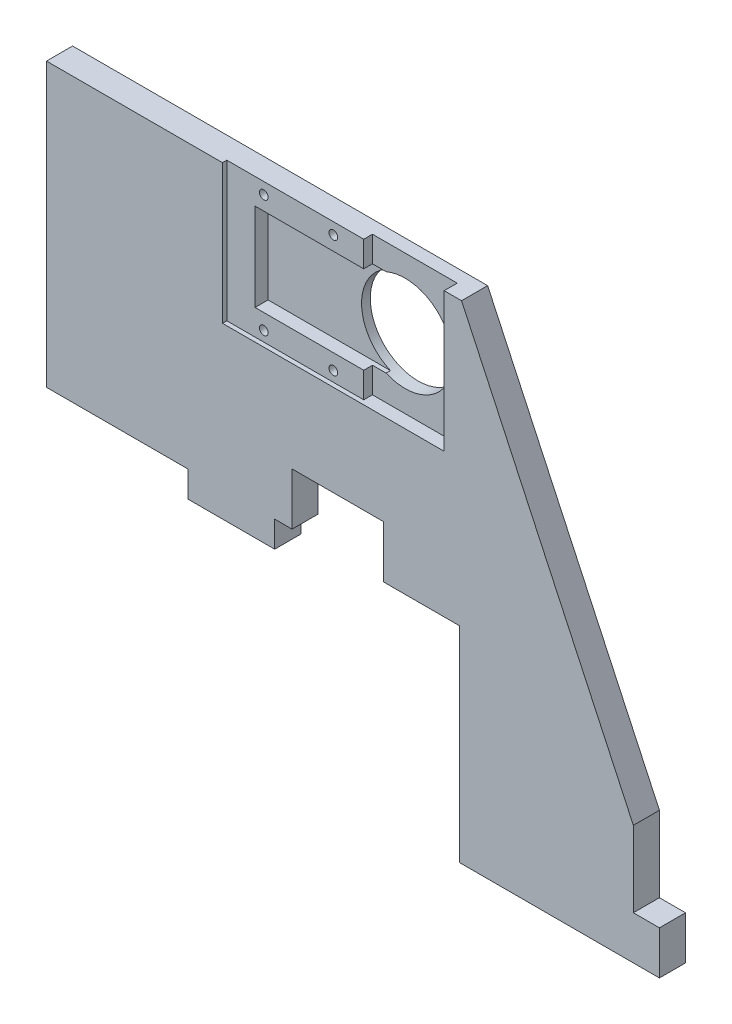
ISO-10303-21;
HEADER;
FILE_DESCRIPTION(('STEP AP214'),'2;1');
FILE_NAME('part.step','',(''),(''),'','','');
FILE_SCHEMA(('AUTOMOTIVE_DESIGN { 1 0 10303 214 1 1 1 1 }'));
ENDSEC;
DATA;
#1=APPLICATION_CONTEXT('core data for automotive mechanical design processes');
#2=APPLICATION_PROTOCOL_DEFINITION('international standard','automotive_design',2000,#1);
#3=PRODUCT_CONTEXT('',#1,'mechanical');
#4=PRODUCT('Part','Part','',(#3));
#5=PRODUCT_RELATED_PRODUCT_CATEGORY('part','',(#4));
#6=PRODUCT_DEFINITION_FORMATION('','',#4);
#7=PRODUCT_DEFINITION_CONTEXT('part definition',#1,'design');
#8=PRODUCT_DEFINITION('design','',#6,#7);
#9=PRODUCT_DEFINITION_SHAPE('','',#8);
#10=(LENGTH_UNIT() NAMED_UNIT(*) SI_UNIT(.MILLI.,.METRE.));
#11=(NAMED_UNIT(*) PLANE_ANGLE_UNIT() SI_UNIT($,.RADIAN.));
#12=(NAMED_UNIT(*) SI_UNIT($,.STERADIAN.) SOLID_ANGLE_UNIT());
#13=UNCERTAINTY_MEASURE_WITH_UNIT(LENGTH_MEASURE(1.E-05),#10,'distance_accuracy_value','');
#14=(GEOMETRIC_REPRESENTATION_CONTEXT(3) GLOBAL_UNCERTAINTY_ASSIGNED_CONTEXT((#13)) GLOBAL_UNIT_ASSIGNED_CONTEXT((#10,
#11,#12)) REPRESENTATION_CONTEXT('',''));
#15=CARTESIAN_POINT('',(0.,0.,0.));
#16=DIRECTION('',(0.,0.,1.));
#17=DIRECTION('',(1.,0.,0.));
#18=AXIS2_PLACEMENT_3D('',#15,#16,#17);
#19=CARTESIAN_POINT('',(-38.5,-8.91500000000001,0.));
#20=DIRECTION('',(0.,1.,0.));
#21=DIRECTION('',(0.,0.,1.));
#22=AXIS2_PLACEMENT_3D('',#19,#20,#21);
#23=PLANE('',#22);
#24=DIRECTION('',(-1.,0.,0.));
#25=VECTOR('',#24,1.);
#26=CARTESIAN_POINT('',(-38.5,-8.91500000000001,0.));
#27=LINE('',#26,#25);
#28=CARTESIAN_POINT('',(-11.,-8.915,0.));
#29=VERTEX_POINT('',#28);
#30=CARTESIAN_POINT('',(-15.,-8.91500000000001,0.));
#31=VERTEX_POINT('',#30);
#32=EDGE_CURVE('E241',#29,#31,#27,.T.);
#33=ORIENTED_EDGE('',*,*,#32,.F.);
#34=DIRECTION('',(0.,0.,1.));
#35=VECTOR('',#34,1.);
#36=CARTESIAN_POINT('',(-11.,-8.915,0.));
#37=LINE('',#36,#35);
#38=CARTESIAN_POINT('',(-11.,-8.915,6.));
#39=VERTEX_POINT('',#38);
#40=EDGE_CURVE('E225',#29,#39,#37,.T.);
#41=ORIENTED_EDGE('',*,*,#40,.T.);
#42=DIRECTION('',(-1.,0.,0.));
#43=VECTOR('',#42,1.);
#44=CARTESIAN_POINT('',(-38.5,-8.91500000000001,6.));
#45=LINE('',#44,#43);
#46=CARTESIAN_POINT('',(-15.,-8.91500000000001,6.));
#47=VERTEX_POINT('',#46);
#48=EDGE_CURVE('E266',#39,#47,#45,.T.);
#49=ORIENTED_EDGE('',*,*,#48,.T.);
#50=DIRECTION('',(0.,0.,1.));
#51=VECTOR('',#50,1.);
#52=CARTESIAN_POINT('',(-15.,-8.915,0.));
#53=LINE('',#52,#51);
#54=EDGE_CURVE('E247',#31,#47,#53,.T.);
#55=ORIENTED_EDGE('',*,*,#54,.F.);
#56=EDGE_LOOP('',(#33,#41,#49,#55));
#57=FACE_BOUND('',#56,.T.);
#58=ADVANCED_FACE('F33',(#57),#23,.F.);
#59=CARTESIAN_POINT('',(0.,0.,3.));
#60=DIRECTION('',(0.,0.,1.));
#61=DIRECTION('',(1.,0.,0.));
#62=AXIS2_PLACEMENT_3D('',#59,#60,#61);
#63=PLANE('',#62);
#64=DIRECTION('',(1.,0.,0.));
#65=VECTOR('',#64,1.);
#66=CARTESIAN_POINT('',(-20.5195740286363,29.985,3.));
#67=LINE('',#66,#65);
#68=CARTESIAN_POINT('',(4.4804259713637,29.985,3.));
#69=VERTEX_POINT('',#68);
#70=CARTESIAN_POINT('',(7.62267425746352,29.985,3.));
#71=VERTEX_POINT('',#70);
#72=EDGE_CURVE('E515',#69,#71,#67,.T.);
#73=ORIENTED_EDGE('',*,*,#72,.F.);
#74=DIRECTION('',(0.,1.,0.));
#75=VECTOR('',#74,1.);
#76=CARTESIAN_POINT('',(4.4804259713637,29.985,3.));
#77=LINE('',#76,#75);
#78=CARTESIAN_POINT('',(4.48042597136369,24.085,3.));
#79=VERTEX_POINT('',#78);
#80=EDGE_CURVE('E489',#79,#69,#77,.T.);
#81=ORIENTED_EDGE('',*,*,#80,.F.);
#82=DIRECTION('',(1.,0.,0.));
#83=VECTOR('',#82,1.);
#84=CARTESIAN_POINT('',(-27.0195740286363,24.085,3.));
#85=LINE('',#84,#83);
#86=CARTESIAN_POINT('',(23.9804259713637,24.085,3.));
#87=VERTEX_POINT('',#86);
#88=EDGE_CURVE('E537',#79,#87,#85,.T.);
#89=ORIENTED_EDGE('',*,*,#88,.T.);
#90=DIRECTION('',(0.,1.,0.));
#91=VECTOR('',#90,1.);
#92=CARTESIAN_POINT('',(23.9804259713637,56.085,3.));
#93=LINE('',#92,#91);
#94=CARTESIAN_POINT('',(23.9804259713637,56.085,3.));
#95=VERTEX_POINT('',#94);
#96=EDGE_CURVE('E539',#87,#95,#93,.T.);
#97=ORIENTED_EDGE('',*,*,#96,.T.);
#98=DIRECTION('',(-1.,0.,0.));
#99=VECTOR('',#98,1.);
#100=CARTESIAN_POINT('',(-27.0195740286363,56.085,3.));
#101=LINE('',#100,#99);
#102=CARTESIAN_POINT('',(4.4804259713637,56.085,3.));
#103=VERTEX_POINT('',#102);
#104=EDGE_CURVE('E543',#95,#103,#101,.T.);
#105=ORIENTED_EDGE('',*,*,#104,.T.);
#106=DIRECTION('',(0.,1.,0.));
#107=VECTOR('',#106,1.);
#108=CARTESIAN_POINT('',(4.4804259713637,56.085,3.));
#109=LINE('',#108,#107);
#110=CARTESIAN_POINT('',(4.4804259713637,50.185,3.));
#111=VERTEX_POINT('',#110);
#112=EDGE_CURVE('E501',#111,#103,#109,.T.);
#113=ORIENTED_EDGE('',*,*,#112,.F.);
#114=DIRECTION('',(-1.,0.,0.));
#115=VECTOR('',#114,1.);
#116=CARTESIAN_POINT('',(-20.5195740286363,50.185,3.));
#117=LINE('',#116,#115);
#118=CARTESIAN_POINT('',(7.62267425746353,50.185,3.));
#119=VERTEX_POINT('',#118);
#120=EDGE_CURVE('E520',#119,#111,#117,.T.);
#121=ORIENTED_EDGE('',*,*,#120,.F.);
#122=CARTESIAN_POINT('',(11.9804259713637,40.085,3.));
#123=DIRECTION('',(0.,0.,1.));
#124=DIRECTION('',(1.,0.,0.));
#125=AXIS2_PLACEMENT_3D('',#122,#123,#124);
#126=CIRCLE('',#125,11.);
#127=EDGE_CURVE('E530',#71,#119,#126,.T.);
#128=ORIENTED_EDGE('',*,*,#127,.F.);
#129=EDGE_LOOP('',(#73,#81,#89,#97,#105,#113,#121,#128));
#130=FACE_BOUND('',#129,.T.);
#131=ADVANCED_FACE('F419',(#130),#63,.T.);
#132=CARTESIAN_POINT('',(-27.0195740286363,24.085,3.));
#133=DIRECTION('',(0.,-1.,0.));
#134=DIRECTION('',(0.,0.,-1.));
#135=AXIS2_PLACEMENT_3D('',#132,#133,#134);
#136=PLANE('',#135);
#137=DIRECTION('',(1.,0.,0.));
#138=VECTOR('',#137,1.);
#139=CARTESIAN_POINT('',(-20.5195740286363,24.085,5.));
#140=LINE('',#139,#138);
#141=CARTESIAN_POINT('',(-27.0195740286363,24.085,5.));
#142=VERTEX_POINT('',#141);
#143=CARTESIAN_POINT('',(4.48042597136369,24.085,5.));
#144=VERTEX_POINT('',#143);
#145=EDGE_CURVE('E490',#142,#144,#140,.T.);
#146=ORIENTED_EDGE('',*,*,#145,.F.);
#147=DIRECTION('',(0.,0.,1.));
#148=VECTOR('',#147,1.);
#149=CARTESIAN_POINT('',(-27.0195740286363,24.085,3.));
#150=LINE('',#149,#148);
#151=CARTESIAN_POINT('',(-27.0195740286363,24.085,6.));
#152=VERTEX_POINT('',#151);
#153=EDGE_CURVE('E546',#142,#152,#150,.T.);
#154=ORIENTED_EDGE('',*,*,#153,.T.);
#155=DIRECTION('',(1.,0.,0.));
#156=VECTOR('',#155,1.);
#157=CARTESIAN_POINT('',(-27.0195740286363,24.085,6.));
#158=LINE('',#157,#156);
#159=CARTESIAN_POINT('',(23.9804259713637,24.085,6.));
#160=VERTEX_POINT('',#159);
#161=EDGE_CURVE('E548',#152,#160,#158,.T.);
#162=ORIENTED_EDGE('',*,*,#161,.T.);
#163=DIRECTION('',(0.,0.,1.));
#164=VECTOR('',#163,1.);
#165=CARTESIAN_POINT('',(23.9804259713637,24.085,3.));
#166=LINE('',#165,#164);
#167=EDGE_CURVE('E555',#87,#160,#166,.T.);
#168=ORIENTED_EDGE('',*,*,#167,.F.);
#169=ORIENTED_EDGE('',*,*,#88,.F.);
#170=DIRECTION('',(0.,0.,-1.));
#171=VECTOR('',#170,1.);
#172=CARTESIAN_POINT('',(4.48042597136369,24.085,5.));
#173=LINE('',#172,#171);
#174=EDGE_CURVE('E499',#144,#79,#173,.T.);
#175=ORIENTED_EDGE('',*,*,#174,.F.);
#176=EDGE_LOOP('',(#146,#154,#162,#168,#169,#175));
#177=FACE_BOUND('',#176,.T.);
#178=ADVANCED_FACE('F427',(#177),#136,.F.);
#179=CARTESIAN_POINT('',(-35.,-8.91500000000001,0.));
#180=VERTEX_POINT('',#179);
#181=CARTESIAN_POINT('',(-67.5,-8.91500000000001,0.));
#182=VERTEX_POINT('',#181);
#183=EDGE_CURVE('E250',#180,#182,#27,.T.);
#184=ORIENTED_EDGE('',*,*,#183,.F.);
#185=DIRECTION('',(0.,0.,1.));
#186=VECTOR('',#185,1.);
#187=CARTESIAN_POINT('',(-35.,-8.915,0.));
#188=LINE('',#187,#186);
#189=CARTESIAN_POINT('',(-35.,-8.915,6.));
#190=VERTEX_POINT('',#189);
#191=EDGE_CURVE('E353',#180,#190,#188,.T.);
#192=ORIENTED_EDGE('',*,*,#191,.T.);
#193=CARTESIAN_POINT('',(-67.5,-8.91500000000001,6.));
#194=VERTEX_POINT('',#193);
#195=EDGE_CURVE('E261',#190,#194,#45,.T.);
#196=ORIENTED_EDGE('',*,*,#195,.T.);
#197=DIRECTION('',(0.,0.,1.));
#198=VECTOR('',#197,1.);
#199=CARTESIAN_POINT('',(-67.5,-8.91500000000001,0.));
#200=LINE('',#199,#198);
#201=EDGE_CURVE('E270',#182,#194,#200,.T.);
#202=ORIENTED_EDGE('',*,*,#201,.F.);
#203=EDGE_LOOP('',(#184,#192,#196,#202));
#204=FACE_BOUND('',#203,.T.);
#205=ADVANCED_FACE('F350',(#204),#23,.F.);
#206=CARTESIAN_POINT('',(67.5,56.085,6.));
#207=DIRECTION('',(-1.,0.,0.));
#208=DIRECTION('',(0.,0.,1.));
#209=AXIS2_PLACEMENT_3D('',#206,#207,#208);
#210=PLANE('',#209);
#211=DIRECTION('',(0.,0.,1.));
#212=VECTOR('',#211,1.);
#213=CARTESIAN_POINT('',(67.5,-46.085,0.));
#214=LINE('',#213,#212);
#215=CARTESIAN_POINT('',(67.5,-46.085,0.));
#216=VERTEX_POINT('',#215);
#217=CARTESIAN_POINT('',(67.5,-46.085,6.));
#218=VERTEX_POINT('',#217);
#219=EDGE_CURVE('E292',#216,#218,#214,.T.);
#220=ORIENTED_EDGE('',*,*,#219,.F.);
#221=DIRECTION('',(0.,1.,0.));
#222=VECTOR('',#221,1.);
#223=CARTESIAN_POINT('',(67.5,56.085,0.));
#224=LINE('',#223,#222);
#225=CARTESIAN_POINT('',(67.5,-28.6649999999999,0.));
#226=VERTEX_POINT('',#225);
#227=EDGE_CURVE('E289',#216,#226,#224,.T.);
#228=ORIENTED_EDGE('',*,*,#227,.T.);
#229=DIRECTION('',(0.,0.,1.));
#230=VECTOR('',#229,1.);
#231=CARTESIAN_POINT('',(67.5,-28.665,0.));
#232=LINE('',#231,#230);
#233=CARTESIAN_POINT('',(67.5,-28.665,6.));
#234=VERTEX_POINT('',#233);
#235=EDGE_CURVE('E262',#226,#234,#232,.T.);
#236=ORIENTED_EDGE('',*,*,#235,.T.);
#237=DIRECTION('',(0.,1.,0.));
#238=VECTOR('',#237,1.);
#239=CARTESIAN_POINT('',(67.5,56.085,6.));
#240=LINE('',#239,#238);
#241=EDGE_CURVE('E280',#218,#234,#240,.T.);
#242=ORIENTED_EDGE('',*,*,#241,.F.);
#243=EDGE_LOOP('',(#220,#228,#236,#242));
#244=FACE_BOUND('',#243,.T.);
#245=ADVANCED_FACE('F396',(#244),#210,.F.);
#246=CARTESIAN_POINT('',(-67.5,56.085,6.));
#247=DIRECTION('',(1.,0.,0.));
#248=DIRECTION('',(0.,0.,-1.));
#249=AXIS2_PLACEMENT_3D('',#246,#247,#248);
#250=PLANE('',#249);
#251=DIRECTION('',(0.,-1.,0.));
#252=VECTOR('',#251,1.);
#253=CARTESIAN_POINT('',(-67.5,56.085,0.));
#254=LINE('',#253,#252);
#255=CARTESIAN_POINT('',(-67.5,56.085,0.));
#256=VERTEX_POINT('',#255);
#257=EDGE_CURVE('E269',#256,#182,#254,.T.);
#258=ORIENTED_EDGE('',*,*,#257,.T.);
#259=ORIENTED_EDGE('',*,*,#201,.T.);
#260=DIRECTION('',(0.,-1.,0.));
#261=VECTOR('',#260,1.);
#262=CARTESIAN_POINT('',(-67.5,56.085,6.));
#263=LINE('',#262,#261);
#264=CARTESIAN_POINT('',(-67.5,56.085,6.));
#265=VERTEX_POINT('',#264);
#266=EDGE_CURVE('E274',#265,#194,#263,.T.);
#267=ORIENTED_EDGE('',*,*,#266,.F.);
#268=DIRECTION('',(0.,0.,-1.));
#269=VECTOR('',#268,1.);
#270=CARTESIAN_POINT('',(-67.5,56.085,6.));
#271=LINE('',#270,#269);
#272=EDGE_CURVE('E335',#265,#256,#271,.T.);
#273=ORIENTED_EDGE('',*,*,#272,.T.);
#274=EDGE_LOOP('',(#258,#259,#267,#273));
#275=FACE_BOUND('',#274,.T.);
#276=ADVANCED_FACE('F35',(#275),#250,.F.);
#277=CARTESIAN_POINT('',(-67.5,-56.085,6.));
#278=DIRECTION('',(0.,1.,0.));
#279=DIRECTION('',(0.,0.,1.));
#280=AXIS2_PLACEMENT_3D('',#277,#278,#279);
#281=PLANE('',#280);
#282=DIRECTION('',(1.,0.,0.));
#283=VECTOR('',#282,1.);
#284=CARTESIAN_POINT('',(-67.5,-56.085,6.));
#285=LINE('',#284,#283);
#286=CARTESIAN_POINT('',(27.5,-56.085,6.));
#287=VERTEX_POINT('',#286);
#288=CARTESIAN_POINT('',(73.5,-56.085,6.));
#289=VERTEX_POINT('',#288);
#290=EDGE_CURVE('E277',#287,#289,#285,.T.);
#291=ORIENTED_EDGE('',*,*,#290,.F.);
#292=DIRECTION('',(0.,0.,1.));
#293=VECTOR('',#292,1.);
#294=CARTESIAN_POINT('',(27.5,-56.085,0.));
#295=LINE('',#294,#293);
#296=CARTESIAN_POINT('',(27.5,-56.085,0.));
#297=VERTEX_POINT('',#296);
#298=EDGE_CURVE('E267',#297,#287,#295,.T.);
#299=ORIENTED_EDGE('',*,*,#298,.F.);
#300=DIRECTION('',(1.,0.,0.));
#301=VECTOR('',#300,1.);
#302=CARTESIAN_POINT('',(-67.5,-56.085,0.));
#303=LINE('',#302,#301);
#304=CARTESIAN_POINT('',(73.5,-56.085,0.));
#305=VERTEX_POINT('',#304);
#306=EDGE_CURVE('E397',#297,#305,#303,.T.);
#307=ORIENTED_EDGE('',*,*,#306,.T.);
#308=DIRECTION('',(0.,0.,1.));
#309=VECTOR('',#308,1.);
#310=CARTESIAN_POINT('',(73.5,-56.085,0.));
#311=LINE('',#310,#309);
#312=EDGE_CURVE('E306',#305,#289,#311,.T.);
#313=ORIENTED_EDGE('',*,*,#312,.T.);
#314=EDGE_LOOP('',(#291,#299,#307,#313));
#315=FACE_BOUND('',#314,.T.);
#316=ADVANCED_FACE('F404',(#315),#281,.F.);
#317=CARTESIAN_POINT('',(-67.5,56.085,6.));
#318=DIRECTION('',(0.,-1.,0.));
#319=DIRECTION('',(0.,0.,-1.));
#320=AXIS2_PLACEMENT_3D('',#317,#318,#319);
#321=PLANE('',#320);
#322=DIRECTION('',(0.,0.,1.));
#323=VECTOR('',#322,1.);
#324=CARTESIAN_POINT('',(-27.0195740286363,56.085,3.));
#325=LINE('',#324,#323);
#326=CARTESIAN_POINT('',(-27.0195740286363,56.085,5.));
#327=VERTEX_POINT('',#326);
#328=CARTESIAN_POINT('',(-27.0195740286363,56.085,6.));
#329=VERTEX_POINT('',#328);
#330=EDGE_CURVE('E552',#327,#329,#325,.T.);
#331=ORIENTED_EDGE('',*,*,#330,.F.);
#332=DIRECTION('',(-1.,0.,0.));
#333=VECTOR('',#332,1.);
#334=CARTESIAN_POINT('',(4.4804259713637,56.085,5.));
#335=LINE('',#334,#333);
#336=CARTESIAN_POINT('',(4.4804259713637,56.085,5.));
#337=VERTEX_POINT('',#336);
#338=EDGE_CURVE('E505',#337,#327,#335,.T.);
#339=ORIENTED_EDGE('',*,*,#338,.F.);
#340=DIRECTION('',(0.,0.,-1.));
#341=VECTOR('',#340,1.);
#342=CARTESIAN_POINT('',(4.4804259713637,56.085,5.));
#343=LINE('',#342,#341);
#344=EDGE_CURVE('E513',#337,#103,#343,.T.);
#345=ORIENTED_EDGE('',*,*,#344,.T.);
#346=ORIENTED_EDGE('',*,*,#104,.F.);
#347=DIRECTION('',(0.,0.,1.));
#348=VECTOR('',#347,1.);
#349=CARTESIAN_POINT('',(23.9804259713637,56.085,3.));
#350=LINE('',#349,#348);
#351=CARTESIAN_POINT('',(23.9804259713637,56.085,6.));
#352=VERTEX_POINT('',#351);
#353=EDGE_CURVE('E334',#95,#352,#350,.T.);
#354=ORIENTED_EDGE('',*,*,#353,.T.);
#355=DIRECTION('',(-1.,0.,0.));
#356=VECTOR('',#355,1.);
#357=CARTESIAN_POINT('',(-67.5,56.085,6.));
#358=LINE('',#357,#356);
#359=CARTESIAN_POINT('',(27.9804259713637,56.085,6.));
#360=VERTEX_POINT('',#359);
#361=EDGE_CURVE('E283',#360,#352,#358,.T.);
#362=ORIENTED_EDGE('',*,*,#361,.F.);
#363=DIRECTION('',(0.,0.,1.));
#364=VECTOR('',#363,1.);
#365=CARTESIAN_POINT('',(27.9804259713637,56.085,0.));
#366=LINE('',#365,#364);
#367=CARTESIAN_POINT('',(27.9804259713637,56.085,0.));
#368=VERTEX_POINT('',#367);
#369=EDGE_CURVE('E313',#368,#360,#366,.T.);
#370=ORIENTED_EDGE('',*,*,#369,.F.);
#371=DIRECTION('',(-1.,0.,0.));
#372=VECTOR('',#371,1.);
#373=CARTESIAN_POINT('',(-67.5,56.085,0.));
#374=LINE('',#373,#372);
#375=EDGE_CURVE('E278',#368,#256,#374,.T.);
#376=ORIENTED_EDGE('',*,*,#375,.T.);
#377=ORIENTED_EDGE('',*,*,#272,.F.);
#378=EDGE_CURVE('E288',#329,#265,#358,.T.);
#379=ORIENTED_EDGE('',*,*,#378,.F.);
#380=EDGE_LOOP('',(#331,#339,#345,#346,#354,#362,#370,#376,#377,#379));
#381=FACE_BOUND('',#380,.T.);
#382=ADVANCED_FACE('F332',(#381),#321,.F.);
#383=CARTESIAN_POINT('',(0.,0.,6.));
#384=DIRECTION('',(0.,0.,1.));
#385=DIRECTION('',(1.,0.,0.));
#386=AXIS2_PLACEMENT_3D('',#383,#384,#385);
#387=PLANE('',#386);
#388=DIRECTION('',(0.,-1.,0.));
#389=VECTOR('',#388,1.);
#390=CARTESIAN_POINT('',(-11.,-8.915,6.));
#391=LINE('',#390,#389);
#392=CARTESIAN_POINT('',(-11.,3.085,6.));
#393=VERTEX_POINT('',#392);
#394=EDGE_CURVE('E231',#393,#39,#391,.T.);
#395=ORIENTED_EDGE('',*,*,#394,.F.);
#396=DIRECTION('',(-1.,0.,0.));
#397=VECTOR('',#396,1.);
#398=CARTESIAN_POINT('',(-11.,3.085,6.));
#399=LINE('',#398,#397);
#400=CARTESIAN_POINT('',(10.,3.085,6.));
#401=VERTEX_POINT('',#400);
#402=EDGE_CURVE('E244',#401,#393,#399,.T.);
#403=ORIENTED_EDGE('',*,*,#402,.F.);
#404=DIRECTION('',(0.,1.,0.));
#405=VECTOR('',#404,1.);
#406=CARTESIAN_POINT('',(10.,-8.915,6.));
#407=LINE('',#406,#405);
#408=CARTESIAN_POINT('',(10.,-8.915,6.));
#409=VERTEX_POINT('',#408);
#410=EDGE_CURVE('E447',#409,#401,#407,.T.);
#411=ORIENTED_EDGE('',*,*,#410,.F.);
#412=CARTESIAN_POINT('',(27.5,-8.915,6.));
#413=VERTEX_POINT('',#412);
#414=EDGE_CURVE('E263',#413,#409,#45,.T.);
#415=ORIENTED_EDGE('',*,*,#414,.F.);
#416=DIRECTION('',(0.,1.,0.));
#417=VECTOR('',#416,1.);
#418=CARTESIAN_POINT('',(27.5,-56.085,6.));
#419=LINE('',#418,#417);
#420=EDGE_CURVE('E258',#287,#413,#419,.T.);
#421=ORIENTED_EDGE('',*,*,#420,.F.);
#422=ORIENTED_EDGE('',*,*,#290,.T.);
#423=DIRECTION('',(0.,1.,0.));
#424=VECTOR('',#423,1.);
#425=CARTESIAN_POINT('',(73.5,-56.085,6.));
#426=LINE('',#425,#424);
#427=CARTESIAN_POINT('',(73.5,-46.085,6.));
#428=VERTEX_POINT('',#427);
#429=EDGE_CURVE('E303',#289,#428,#426,.T.);
#430=ORIENTED_EDGE('',*,*,#429,.T.);
#431=DIRECTION('',(-1.,0.,0.));
#432=VECTOR('',#431,1.);
#433=CARTESIAN_POINT('',(67.5,-46.085,6.));
#434=LINE('',#433,#432);
#435=EDGE_CURVE('E298',#428,#218,#434,.T.);
#436=ORIENTED_EDGE('',*,*,#435,.T.);
#437=ORIENTED_EDGE('',*,*,#241,.T.);
#438=DIRECTION('',(0.422618261740701,-0.906307787036649,0.));
#439=VECTOR('',#438,1.);
#440=CARTESIAN_POINT('',(67.5,-28.665,6.));
#441=LINE('',#440,#439);
#442=EDGE_CURVE('E296',#360,#234,#441,.T.);
#443=ORIENTED_EDGE('',*,*,#442,.F.);
#444=ORIENTED_EDGE('',*,*,#361,.T.);
#445=DIRECTION('',(0.,1.,0.));
#446=VECTOR('',#445,1.);
#447=CARTESIAN_POINT('',(23.9804259713637,56.085,6.));
#448=LINE('',#447,#446);
#449=EDGE_CURVE('E540',#160,#352,#448,.T.);
#450=ORIENTED_EDGE('',*,*,#449,.F.);
#451=ORIENTED_EDGE('',*,*,#161,.F.);
#452=DIRECTION('',(0.,-1.,0.));
#453=VECTOR('',#452,1.);
#454=CARTESIAN_POINT('',(-27.0195740286363,56.085,6.));
#455=LINE('',#454,#453);
#456=EDGE_CURVE('E344',#329,#152,#455,.T.);
#457=ORIENTED_EDGE('',*,*,#456,.F.);
#458=ORIENTED_EDGE('',*,*,#378,.T.);
#459=ORIENTED_EDGE('',*,*,#266,.T.);
#460=ORIENTED_EDGE('',*,*,#195,.F.);
#461=DIRECTION('',(0.,-1.,0.));
#462=VECTOR('',#461,1.);
#463=CARTESIAN_POINT('',(-35.,-8.915,6.));
#464=LINE('',#463,#462);
#465=CARTESIAN_POINT('',(-35.,-14.915,6.));
#466=VERTEX_POINT('',#465);
#467=EDGE_CURVE('E372',#190,#466,#464,.T.);
#468=ORIENTED_EDGE('',*,*,#467,.T.);
#469=DIRECTION('',(1.,0.,0.));
#470=VECTOR('',#469,1.);
#471=CARTESIAN_POINT('',(-35.,-14.915,6.));
#472=LINE('',#471,#470);
#473=CARTESIAN_POINT('',(-15.,-14.915,6.));
#474=VERTEX_POINT('',#473);
#475=EDGE_CURVE('E366',#466,#474,#472,.T.);
#476=ORIENTED_EDGE('',*,*,#475,.T.);
#477=DIRECTION('',(0.,1.,0.));
#478=VECTOR('',#477,1.);
#479=CARTESIAN_POINT('',(-15.,-8.915,6.));
#480=LINE('',#479,#478);
#481=EDGE_CURVE('E360',#474,#47,#480,.T.);
#482=ORIENTED_EDGE('',*,*,#481,.T.);
#483=ORIENTED_EDGE('',*,*,#48,.F.);
#484=EDGE_LOOP('',(#395,#403,#411,#415,#421,#422,#430,#436,#437,#443,#444,#450,#451,#457,#458,
#459,#460,#468,#476,#482,#483));
#485=FACE_BOUND('',#484,.T.);
#486=ADVANCED_FACE('F327',(#485),#387,.T.);
#487=CARTESIAN_POINT('',(0.,0.,0.));
#488=DIRECTION('',(0.,0.,1.));
#489=DIRECTION('',(1.,0.,0.));
#490=AXIS2_PLACEMENT_3D('',#487,#488,#489);
#491=PLANE('',#490);
#492=CARTESIAN_POINT('',(-2.51957402863629,26.435,0.));
#493=DIRECTION('',(0.,0.,1.));
#494=DIRECTION('',(1.,0.,0.));
#495=AXIS2_PLACEMENT_3D('',#492,#493,#494);
#496=CIRCLE('',#495,1.);
#497=CARTESIAN_POINT('',(-1.51957402863629,26.435,0.));
#498=VERTEX_POINT('',#497);
#499=EDGE_CURVE('E462',#498,#498,#496,.T.);
#500=ORIENTED_EDGE('',*,*,#499,.T.);
#501=EDGE_LOOP('',(#500));
#502=FACE_BOUND('',#501,.T.);
#503=CARTESIAN_POINT('',(-18.5195740286363,26.435,0.));
#504=DIRECTION('',(0.,0.,1.));
#505=DIRECTION('',(1.,0.,0.));
#506=AXIS2_PLACEMENT_3D('',#503,#504,#505);
#507=CIRCLE('',#506,1.);
#508=CARTESIAN_POINT('',(-17.5195740286363,26.435,0.));
#509=VERTEX_POINT('',#508);
#510=EDGE_CURVE('E468',#509,#509,#507,.T.);
#511=ORIENTED_EDGE('',*,*,#510,.T.);
#512=EDGE_LOOP('',(#511));
#513=FACE_BOUND('',#512,.T.);
#514=CARTESIAN_POINT('',(-2.51957402863629,53.435,0.));
#515=DIRECTION('',(0.,0.,1.));
#516=DIRECTION('',(1.,0.,0.));
#517=AXIS2_PLACEMENT_3D('',#514,#515,#516);
#518=CIRCLE('',#517,1.);
#519=CARTESIAN_POINT('',(-1.51957402863629,53.435,0.));
#520=VERTEX_POINT('',#519);
#521=EDGE_CURVE('E474',#520,#520,#518,.T.);
#522=ORIENTED_EDGE('',*,*,#521,.T.);
#523=EDGE_LOOP('',(#522));
#524=FACE_BOUND('',#523,.T.);
#525=CARTESIAN_POINT('',(-18.5195740286363,53.435,0.));
#526=DIRECTION('',(0.,0.,1.));
#527=DIRECTION('',(1.,0.,0.));
#528=AXIS2_PLACEMENT_3D('',#525,#526,#527);
#529=CIRCLE('',#528,1.);
#530=CARTESIAN_POINT('',(-17.5195740286363,53.435,0.));
#531=VERTEX_POINT('',#530);
#532=EDGE_CURVE('E480',#531,#531,#529,.T.);
#533=ORIENTED_EDGE('',*,*,#532,.T.);
#534=EDGE_LOOP('',(#533));
#535=FACE_BOUND('',#534,.T.);
#536=CARTESIAN_POINT('',(11.9804259713637,40.085,0.));
#537=DIRECTION('',(0.,0.,1.));
#538=DIRECTION('',(1.,0.,0.));
#539=AXIS2_PLACEMENT_3D('',#536,#537,#538);
#540=CIRCLE('',#539,11.);
#541=CARTESIAN_POINT('',(22.9804259713637,40.085,0.));
#542=VERTEX_POINT('',#541);
#543=EDGE_CURVE('E534',#542,#542,#540,.T.);
#544=ORIENTED_EDGE('',*,*,#543,.T.);
#545=EDGE_LOOP('',(#544));
#546=FACE_BOUND('',#545,.T.);
#547=DIRECTION('',(-1.,0.,0.));
#548=VECTOR('',#547,1.);
#549=CARTESIAN_POINT('',(-11.,3.085,0.));
#550=LINE('',#549,#548);
#551=CARTESIAN_POINT('',(10.,3.085,0.));
#552=VERTEX_POINT('',#551);
#553=CARTESIAN_POINT('',(-11.,3.085,0.));
#554=VERTEX_POINT('',#553);
#555=EDGE_CURVE('E236',#552,#554,#550,.T.);
#556=ORIENTED_EDGE('',*,*,#555,.T.);
#557=DIRECTION('',(0.,-1.,0.));
#558=VECTOR('',#557,1.);
#559=CARTESIAN_POINT('',(-11.,-8.915,0.));
#560=LINE('',#559,#558);
#561=EDGE_CURVE('E228',#554,#29,#560,.T.);
#562=ORIENTED_EDGE('',*,*,#561,.T.);
#563=ORIENTED_EDGE('',*,*,#32,.T.);
#564=DIRECTION('',(0.,1.,0.));
#565=VECTOR('',#564,1.);
#566=CARTESIAN_POINT('',(-15.,-8.915,0.));
#567=LINE('',#566,#565);
#568=CARTESIAN_POINT('',(-15.,-14.915,0.));
#569=VERTEX_POINT('',#568);
#570=EDGE_CURVE('E362',#569,#31,#567,.T.);
#571=ORIENTED_EDGE('',*,*,#570,.F.);
#572=DIRECTION('',(1.,0.,0.));
#573=VECTOR('',#572,1.);
#574=CARTESIAN_POINT('',(-35.,-14.915,0.));
#575=LINE('',#574,#573);
#576=CARTESIAN_POINT('',(-35.,-14.915,0.));
#577=VERTEX_POINT('',#576);
#578=EDGE_CURVE('E370',#577,#569,#575,.T.);
#579=ORIENTED_EDGE('',*,*,#578,.F.);
#580=DIRECTION('',(0.,-1.,0.));
#581=VECTOR('',#580,1.);
#582=CARTESIAN_POINT('',(-35.,-8.915,0.));
#583=LINE('',#582,#581);
#584=EDGE_CURVE('E367',#180,#577,#583,.T.);
#585=ORIENTED_EDGE('',*,*,#584,.F.);
#586=ORIENTED_EDGE('',*,*,#183,.T.);
#587=ORIENTED_EDGE('',*,*,#257,.F.);
#588=ORIENTED_EDGE('',*,*,#375,.F.);
#589=DIRECTION('',(0.422618261740701,-0.906307787036649,0.));
#590=VECTOR('',#589,1.);
#591=CARTESIAN_POINT('',(67.5,-28.665,0.));
#592=LINE('',#591,#590);
#593=EDGE_CURVE('E310',#368,#226,#592,.T.);
#594=ORIENTED_EDGE('',*,*,#593,.T.);
#595=ORIENTED_EDGE('',*,*,#227,.F.);
#596=DIRECTION('',(-1.,0.,0.));
#597=VECTOR('',#596,1.);
#598=CARTESIAN_POINT('',(67.5,-46.085,0.));
#599=LINE('',#598,#597);
#600=CARTESIAN_POINT('',(73.5,-46.085,0.));
#601=VERTEX_POINT('',#600);
#602=EDGE_CURVE('E309',#601,#216,#599,.T.);
#603=ORIENTED_EDGE('',*,*,#602,.F.);
#604=DIRECTION('',(0.,1.,0.));
#605=VECTOR('',#604,1.);
#606=CARTESIAN_POINT('',(73.5,-56.085,0.));
#607=LINE('',#606,#605);
#608=EDGE_CURVE('E379',#305,#601,#607,.T.);
#609=ORIENTED_EDGE('',*,*,#608,.F.);
#610=ORIENTED_EDGE('',*,*,#306,.F.);
#611=DIRECTION('',(0.,1.,0.));
#612=VECTOR('',#611,1.);
#613=CARTESIAN_POINT('',(27.5,-56.085,0.));
#614=LINE('',#613,#612);
#615=CARTESIAN_POINT('',(27.5,-8.915,0.));
#616=VERTEX_POINT('',#615);
#617=EDGE_CURVE('E254',#297,#616,#614,.T.);
#618=ORIENTED_EDGE('',*,*,#617,.T.);
#619=CARTESIAN_POINT('',(9.99999999999999,-8.915,0.));
#620=VERTEX_POINT('',#619);
#621=EDGE_CURVE('E249',#616,#620,#27,.T.);
#622=ORIENTED_EDGE('',*,*,#621,.T.);
#623=DIRECTION('',(0.,1.,0.));
#624=VECTOR('',#623,1.);
#625=CARTESIAN_POINT('',(10.,-8.915,0.));
#626=LINE('',#625,#624);
#627=EDGE_CURVE('E48',#620,#552,#626,.T.);
#628=ORIENTED_EDGE('',*,*,#627,.T.);
#629=EDGE_LOOP('',(#556,#562,#563,#571,#579,#585,#586,#587,#588,#594,#595,#603,#609,#610,#618,
#622,#628));
#630=FACE_BOUND('',#629,.T.);
#631=ADVANCED_FACE('F239',(#502,#513,#524,#535,#546,#630),#491,.F.);
#632=CARTESIAN_POINT('',(27.5,-56.085,0.));
#633=DIRECTION('',(1.,0.,0.));
#634=DIRECTION('',(0.,0.,-1.));
#635=AXIS2_PLACEMENT_3D('',#632,#633,#634);
#636=PLANE('',#635);
#637=ORIENTED_EDGE('',*,*,#420,.T.);
#638=DIRECTION('',(0.,0.,1.));
#639=VECTOR('',#638,1.);
#640=CARTESIAN_POINT('',(27.5,-8.915,0.));
#641=LINE('',#640,#639);
#642=EDGE_CURVE('E253',#616,#413,#641,.T.);
#643=ORIENTED_EDGE('',*,*,#642,.F.);
#644=ORIENTED_EDGE('',*,*,#617,.F.);
#645=ORIENTED_EDGE('',*,*,#298,.T.);
#646=EDGE_LOOP('',(#637,#643,#644,#645));
#647=FACE_BOUND('',#646,.T.);
#648=ADVANCED_FACE('F433',(#647),#636,.F.);
#649=ORIENTED_EDGE('',*,*,#414,.T.);
#650=DIRECTION('',(0.,0.,1.));
#651=VECTOR('',#650,1.);
#652=CARTESIAN_POINT('',(10.,-8.915,0.));
#653=LINE('',#652,#651);
#654=EDGE_CURVE('E235',#620,#409,#653,.T.);
#655=ORIENTED_EDGE('',*,*,#654,.F.);
#656=ORIENTED_EDGE('',*,*,#621,.F.);
#657=ORIENTED_EDGE('',*,*,#642,.T.);
#658=EDGE_LOOP('',(#649,#655,#656,#657));
#659=FACE_BOUND('',#658,.T.);
#660=ADVANCED_FACE('F421',(#659),#23,.F.);
#661=CARTESIAN_POINT('',(67.5,-28.665,0.));
#662=DIRECTION('',(-0.906307787036649,-0.422618261740701,0.));
#663=DIRECTION('',(0.422618261740701,-0.906307787036649,0.));
#664=AXIS2_PLACEMENT_3D('',#661,#662,#663);
#665=PLANE('',#664);
#666=ORIENTED_EDGE('',*,*,#442,.T.);
#667=ORIENTED_EDGE('',*,*,#235,.F.);
#668=ORIENTED_EDGE('',*,*,#593,.F.);
#669=ORIENTED_EDGE('',*,*,#369,.T.);
#670=EDGE_LOOP('',(#666,#667,#668,#669));
#671=FACE_BOUND('',#670,.T.);
#672=ADVANCED_FACE('F320',(#671),#665,.F.);
#673=CARTESIAN_POINT('',(67.5,-46.085,0.));
#674=DIRECTION('',(0.,1.,0.));
#675=DIRECTION('',(0.,0.,1.));
#676=AXIS2_PLACEMENT_3D('',#673,#674,#675);
#677=PLANE('',#676);
#678=ORIENTED_EDGE('',*,*,#435,.F.);
#679=DIRECTION('',(0.,0.,1.));
#680=VECTOR('',#679,1.);
#681=CARTESIAN_POINT('',(73.5,-46.085,0.));
#682=LINE('',#681,#680);
#683=EDGE_CURVE('E297',#601,#428,#682,.T.);
#684=ORIENTED_EDGE('',*,*,#683,.F.);
#685=ORIENTED_EDGE('',*,*,#602,.T.);
#686=ORIENTED_EDGE('',*,*,#219,.T.);
#687=EDGE_LOOP('',(#678,#684,#685,#686));
#688=FACE_BOUND('',#687,.T.);
#689=ADVANCED_FACE('F393',(#688),#677,.T.);
#690=CARTESIAN_POINT('',(73.5,-56.085,0.));
#691=DIRECTION('',(1.,0.,0.));
#692=DIRECTION('',(0.,0.,-1.));
#693=AXIS2_PLACEMENT_3D('',#690,#691,#692);
#694=PLANE('',#693);
#695=ORIENTED_EDGE('',*,*,#429,.F.);
#696=ORIENTED_EDGE('',*,*,#312,.F.);
#697=ORIENTED_EDGE('',*,*,#608,.T.);
#698=ORIENTED_EDGE('',*,*,#683,.T.);
#699=EDGE_LOOP('',(#695,#696,#697,#698));
#700=FACE_BOUND('',#699,.T.);
#701=ADVANCED_FACE('F406',(#700),#694,.T.);
#702=CARTESIAN_POINT('',(-35.,-8.915,0.));
#703=DIRECTION('',(-1.,0.,0.));
#704=DIRECTION('',(0.,0.,1.));
#705=AXIS2_PLACEMENT_3D('',#702,#703,#704);
#706=PLANE('',#705);
#707=ORIENTED_EDGE('',*,*,#467,.F.);
#708=ORIENTED_EDGE('',*,*,#191,.F.);
#709=ORIENTED_EDGE('',*,*,#584,.T.);
#710=DIRECTION('',(0.,0.,1.));
#711=VECTOR('',#710,1.);
#712=CARTESIAN_POINT('',(-35.,-14.915,0.));
#713=LINE('',#712,#711);
#714=EDGE_CURVE('E378',#577,#466,#713,.T.);
#715=ORIENTED_EDGE('',*,*,#714,.T.);
#716=EDGE_LOOP('',(#707,#708,#709,#715));
#717=FACE_BOUND('',#716,.T.);
#718=ADVANCED_FACE('F408',(#717),#706,.T.);
#719=CARTESIAN_POINT('',(-15.,-8.915,0.));
#720=DIRECTION('',(1.,0.,0.));
#721=DIRECTION('',(0.,1.,0.));
#722=AXIS2_PLACEMENT_3D('',#719,#720,#721);
#723=PLANE('',#722);
#724=ORIENTED_EDGE('',*,*,#481,.F.);
#725=DIRECTION('',(0.,0.,1.));
#726=VECTOR('',#725,1.);
#727=CARTESIAN_POINT('',(-15.,-14.915,0.));
#728=LINE('',#727,#726);
#729=EDGE_CURVE('E363',#569,#474,#728,.T.);
#730=ORIENTED_EDGE('',*,*,#729,.F.);
#731=ORIENTED_EDGE('',*,*,#570,.T.);
#732=ORIENTED_EDGE('',*,*,#54,.T.);
#733=EDGE_LOOP('',(#724,#730,#731,#732));
#734=FACE_BOUND('',#733,.T.);
#735=ADVANCED_FACE('F359',(#734),#723,.T.);
#736=CARTESIAN_POINT('',(-35.,-14.915,0.));
#737=DIRECTION('',(0.,-1.,0.));
#738=DIRECTION('',(0.,0.,-1.));
#739=AXIS2_PLACEMENT_3D('',#736,#737,#738);
#740=PLANE('',#739);
#741=ORIENTED_EDGE('',*,*,#475,.F.);
#742=ORIENTED_EDGE('',*,*,#714,.F.);
#743=ORIENTED_EDGE('',*,*,#578,.T.);
#744=ORIENTED_EDGE('',*,*,#729,.T.);
#745=EDGE_LOOP('',(#741,#742,#743,#744));
#746=FACE_BOUND('',#745,.T.);
#747=ADVANCED_FACE('F563',(#746),#740,.T.);
#748=CARTESIAN_POINT('',(-27.0195740286363,56.085,3.));
#749=DIRECTION('',(-1.,0.,0.));
#750=DIRECTION('',(0.,-1.,0.));
#751=AXIS2_PLACEMENT_3D('',#748,#749,#750);
#752=PLANE('',#751);
#753=ORIENTED_EDGE('',*,*,#153,.F.);
#754=DIRECTION('',(0.,-1.,0.));
#755=VECTOR('',#754,1.);
#756=CARTESIAN_POINT('',(-27.0195740286363,56.085,5.));
#757=LINE('',#756,#755);
#758=EDGE_CURVE('E483',#327,#142,#757,.T.);
#759=ORIENTED_EDGE('',*,*,#758,.F.);
#760=ORIENTED_EDGE('',*,*,#330,.T.);
#761=ORIENTED_EDGE('',*,*,#456,.T.);
#762=EDGE_LOOP('',(#753,#759,#760,#761));
#763=FACE_BOUND('',#762,.T.);
#764=ADVANCED_FACE('F565',(#763),#752,.F.);
#765=CARTESIAN_POINT('',(23.9804259713637,56.085,3.));
#766=DIRECTION('',(1.,0.,0.));
#767=DIRECTION('',(0.,1.,0.));
#768=AXIS2_PLACEMENT_3D('',#765,#766,#767);
#769=PLANE('',#768);
#770=ORIENTED_EDGE('',*,*,#449,.T.);
#771=ORIENTED_EDGE('',*,*,#353,.F.);
#772=ORIENTED_EDGE('',*,*,#96,.F.);
#773=ORIENTED_EDGE('',*,*,#167,.T.);
#774=EDGE_LOOP('',(#770,#771,#772,#773));
#775=FACE_BOUND('',#774,.T.);
#776=ADVANCED_FACE('F571',(#775),#769,.F.);
#777=CARTESIAN_POINT('',(11.9804259713637,40.085,-5.00000000001367E-05));
#778=DIRECTION('',(0.,0.,1.));
#779=DIRECTION('',(1.,0.,0.));
#780=AXIS2_PLACEMENT_3D('',#777,#778,#779);
#781=CYLINDRICAL_SURFACE('',#780,11.);
#782=ORIENTED_EDGE('',*,*,#127,.T.);
#783=DIRECTION('',(0.,0.,1.));
#784=VECTOR('',#783,1.);
#785=CARTESIAN_POINT('',(7.62267425746353,50.185,-5.00000000001367E-05));
#786=LINE('',#785,#784);
#787=CARTESIAN_POINT('',(7.62267425746353,50.185,2.));
#788=VERTEX_POINT('',#787);
#789=EDGE_CURVE('E11',#119,#788,#786,.F.);
#790=ORIENTED_EDGE('',*,*,#789,.T.);
#791=CARTESIAN_POINT('',(11.9804259713637,40.085,2.));
#792=DIRECTION('',(0.,0.,1.));
#793=DIRECTION('',(1.,0.,0.));
#794=AXIS2_PLACEMENT_3D('',#791,#792,#793);
#795=CIRCLE('',#794,11.);
#796=CARTESIAN_POINT('',(7.62267425746352,29.985,2.));
#797=VERTEX_POINT('',#796);
#798=EDGE_CURVE('E337',#797,#788,#795,.F.);
#799=ORIENTED_EDGE('',*,*,#798,.F.);
#800=DIRECTION('',(0.,0.,1.));
#801=VECTOR('',#800,1.);
#802=CARTESIAN_POINT('',(7.62267425746352,29.985,-5.00000000001367E-05));
#803=LINE('',#802,#801);
#804=EDGE_CURVE('E41',#797,#71,#803,.T.);
#805=ORIENTED_EDGE('',*,*,#804,.T.);
#806=EDGE_LOOP('',(#782,#790,#799,#805));
#807=FACE_BOUND('',#806,.T.);
#808=ORIENTED_EDGE('',*,*,#543,.F.);
#809=EDGE_LOOP('',(#808));
#810=FACE_BOUND('',#809,.T.);
#811=ADVANCED_FACE('F580',(#807,#810),#781,.F.);
#812=CARTESIAN_POINT('',(-20.5195740286363,50.185,2.));
#813=DIRECTION('',(0.,1.,0.));
#814=DIRECTION('',(-1.,0.,0.));
#815=AXIS2_PLACEMENT_3D('',#812,#813,#814);
#816=PLANE('',#815);
#817=ORIENTED_EDGE('',*,*,#120,.T.);
#818=DIRECTION('',(0.,0.,-1.));
#819=VECTOR('',#818,1.);
#820=CARTESIAN_POINT('',(4.4804259713637,50.185,5.));
#821=LINE('',#820,#819);
#822=CARTESIAN_POINT('',(4.4804259713637,50.185,5.));
#823=VERTEX_POINT('',#822);
#824=EDGE_CURVE('E509',#823,#111,#821,.T.);
#825=ORIENTED_EDGE('',*,*,#824,.F.);
#826=DIRECTION('',(1.,0.,0.));
#827=VECTOR('',#826,1.);
#828=CARTESIAN_POINT('',(4.4804259713637,50.185,5.));
#829=LINE('',#828,#827);
#830=CARTESIAN_POINT('',(-20.5195740286363,50.185,5.));
#831=VERTEX_POINT('',#830);
#832=EDGE_CURVE('E507',#831,#823,#829,.T.);
#833=ORIENTED_EDGE('',*,*,#832,.F.);
#834=DIRECTION('',(0.,0.,1.));
#835=VECTOR('',#834,1.);
#836=CARTESIAN_POINT('',(-20.5195740286363,50.185,2.));
#837=LINE('',#836,#835);
#838=CARTESIAN_POINT('',(-20.5195740286363,50.185,2.));
#839=VERTEX_POINT('',#838);
#840=EDGE_CURVE('E528',#839,#831,#837,.T.);
#841=ORIENTED_EDGE('',*,*,#840,.F.);
#842=DIRECTION('',(-1.,0.,0.));
#843=VECTOR('',#842,1.);
#844=CARTESIAN_POINT('',(-20.5195740286363,50.185,2.));
#845=LINE('',#844,#843);
#846=EDGE_CURVE('E522',#788,#839,#845,.T.);
#847=ORIENTED_EDGE('',*,*,#846,.F.);
#848=ORIENTED_EDGE('',*,*,#789,.F.);
#849=EDGE_LOOP('',(#817,#825,#833,#841,#847,#848));
#850=FACE_BOUND('',#849,.T.);
#851=ADVANCED_FACE('F585',(#850),#816,.F.);
#852=CARTESIAN_POINT('',(-20.5195740286363,29.985,2.));
#853=DIRECTION('',(0.,-1.,0.));
#854=DIRECTION('',(0.,0.,-1.));
#855=AXIS2_PLACEMENT_3D('',#852,#853,#854);
#856=PLANE('',#855);
#857=DIRECTION('',(1.,0.,0.));
#858=VECTOR('',#857,1.);
#859=CARTESIAN_POINT('',(-20.5195740286363,29.985,2.));
#860=LINE('',#859,#858);
#861=CARTESIAN_POINT('',(-20.5195740286363,29.985,2.));
#862=VERTEX_POINT('',#861);
#863=EDGE_CURVE('E519',#862,#797,#860,.T.);
#864=ORIENTED_EDGE('',*,*,#863,.F.);
#865=DIRECTION('',(0.,0.,1.));
#866=VECTOR('',#865,1.);
#867=CARTESIAN_POINT('',(-20.5195740286363,29.985,2.));
#868=LINE('',#867,#866);
#869=CARTESIAN_POINT('',(-20.5195740286363,29.985,5.));
#870=VERTEX_POINT('',#869);
#871=EDGE_CURVE('E524',#862,#870,#868,.T.);
#872=ORIENTED_EDGE('',*,*,#871,.T.);
#873=DIRECTION('',(-1.,0.,0.));
#874=VECTOR('',#873,1.);
#875=CARTESIAN_POINT('',(-20.5195740286363,29.985,5.));
#876=LINE('',#875,#874);
#877=CARTESIAN_POINT('',(4.4804259713637,29.985,5.));
#878=VERTEX_POINT('',#877);
#879=EDGE_CURVE('E494',#878,#870,#876,.T.);
#880=ORIENTED_EDGE('',*,*,#879,.F.);
#881=DIRECTION('',(0.,0.,-1.));
#882=VECTOR('',#881,1.);
#883=CARTESIAN_POINT('',(4.4804259713637,29.985,5.));
#884=LINE('',#883,#882);
#885=EDGE_CURVE('E56',#878,#69,#884,.T.);
#886=ORIENTED_EDGE('',*,*,#885,.T.);
#887=ORIENTED_EDGE('',*,*,#72,.T.);
#888=ORIENTED_EDGE('',*,*,#804,.F.);
#889=EDGE_LOOP('',(#864,#872,#880,#886,#887,#888));
#890=FACE_BOUND('',#889,.T.);
#891=ADVANCED_FACE('F593',(#890),#856,.F.);
#892=CARTESIAN_POINT('',(0.,0.,2.));
#893=DIRECTION('',(0.,0.,1.));
#894=DIRECTION('',(1.,0.,0.));
#895=AXIS2_PLACEMENT_3D('',#892,#893,#894);
#896=PLANE('',#895);
#897=ORIENTED_EDGE('',*,*,#798,.T.);
#898=ORIENTED_EDGE('',*,*,#846,.T.);
#899=DIRECTION('',(0.,-1.,0.));
#900=VECTOR('',#899,1.);
#901=CARTESIAN_POINT('',(-20.5195740286363,50.185,2.));
#902=LINE('',#901,#900);
#903=EDGE_CURVE('E516',#839,#862,#902,.T.);
#904=ORIENTED_EDGE('',*,*,#903,.T.);
#905=ORIENTED_EDGE('',*,*,#863,.T.);
#906=EDGE_LOOP('',(#897,#898,#904,#905));
#907=FACE_BOUND('',#906,.T.);
#908=ADVANCED_FACE('F591',(#907),#896,.T.);
#909=CARTESIAN_POINT('',(-20.5195740286363,50.185,2.));
#910=DIRECTION('',(-1.,0.,0.));
#911=DIRECTION('',(0.,0.,1.));
#912=AXIS2_PLACEMENT_3D('',#909,#910,#911);
#913=PLANE('',#912);
#914=ORIENTED_EDGE('',*,*,#840,.T.);
#915=DIRECTION('',(0.,1.,0.));
#916=VECTOR('',#915,1.);
#917=CARTESIAN_POINT('',(-20.5195740286363,56.085,5.));
#918=LINE('',#917,#916);
#919=EDGE_CURVE('E486',#870,#831,#918,.T.);
#920=ORIENTED_EDGE('',*,*,#919,.F.);
#921=ORIENTED_EDGE('',*,*,#871,.F.);
#922=ORIENTED_EDGE('',*,*,#903,.F.);
#923=EDGE_LOOP('',(#914,#920,#921,#922));
#924=FACE_BOUND('',#923,.T.);
#925=ADVANCED_FACE('F587',(#924),#913,.F.);
#926=CARTESIAN_POINT('',(4.4804259713637,56.085,5.));
#927=DIRECTION('',(-1.,0.,0.));
#928=DIRECTION('',(0.,-1.,0.));
#929=AXIS2_PLACEMENT_3D('',#926,#927,#928);
#930=PLANE('',#929);
#931=ORIENTED_EDGE('',*,*,#112,.T.);
#932=ORIENTED_EDGE('',*,*,#344,.F.);
#933=DIRECTION('',(0.,1.,0.));
#934=VECTOR('',#933,1.);
#935=CARTESIAN_POINT('',(4.4804259713637,56.085,5.));
#936=LINE('',#935,#934);
#937=EDGE_CURVE('E502',#823,#337,#936,.T.);
#938=ORIENTED_EDGE('',*,*,#937,.F.);
#939=ORIENTED_EDGE('',*,*,#824,.T.);
#940=EDGE_LOOP('',(#931,#932,#938,#939));
#941=FACE_BOUND('',#940,.T.);
#942=ADVANCED_FACE('F590',(#941),#930,.F.);
#943=CARTESIAN_POINT('',(0.,0.,5.));
#944=DIRECTION('',(0.,0.,-1.));
#945=DIRECTION('',(-1.,0.,0.));
#946=AXIS2_PLACEMENT_3D('',#943,#944,#945);
#947=PLANE('',#946);
#948=CARTESIAN_POINT('',(-2.51957402863629,26.435,5.));
#949=DIRECTION('',(0.,0.,1.));
#950=DIRECTION('',(1.,0.,0.));
#951=AXIS2_PLACEMENT_3D('',#948,#949,#950);
#952=CIRCLE('',#951,1.);
#953=CARTESIAN_POINT('',(-1.51957402863629,26.435,5.));
#954=VERTEX_POINT('',#953);
#955=EDGE_CURVE('E456',#954,#954,#952,.T.);
#956=ORIENTED_EDGE('',*,*,#955,.F.);
#957=EDGE_LOOP('',(#956));
#958=FACE_BOUND('',#957,.T.);
#959=CARTESIAN_POINT('',(-18.5195740286363,26.435,5.));
#960=DIRECTION('',(0.,0.,1.));
#961=DIRECTION('',(1.,0.,0.));
#962=AXIS2_PLACEMENT_3D('',#959,#960,#961);
#963=CIRCLE('',#962,1.);
#964=CARTESIAN_POINT('',(-17.5195740286363,26.435,5.));
#965=VERTEX_POINT('',#964);
#966=EDGE_CURVE('E465',#965,#965,#963,.T.);
#967=ORIENTED_EDGE('',*,*,#966,.F.);
#968=EDGE_LOOP('',(#967));
#969=FACE_BOUND('',#968,.T.);
#970=CARTESIAN_POINT('',(-2.51957402863629,53.435,5.));
#971=DIRECTION('',(0.,0.,1.));
#972=DIRECTION('',(1.,0.,0.));
#973=AXIS2_PLACEMENT_3D('',#970,#971,#972);
#974=CIRCLE('',#973,1.);
#975=CARTESIAN_POINT('',(-1.51957402863629,53.435,5.));
#976=VERTEX_POINT('',#975);
#977=EDGE_CURVE('E471',#976,#976,#974,.T.);
#978=ORIENTED_EDGE('',*,*,#977,.F.);
#979=EDGE_LOOP('',(#978));
#980=FACE_BOUND('',#979,.T.);
#981=CARTESIAN_POINT('',(-18.5195740286363,53.435,5.));
#982=DIRECTION('',(0.,0.,1.));
#983=DIRECTION('',(1.,0.,0.));
#984=AXIS2_PLACEMENT_3D('',#981,#982,#983);
#985=CIRCLE('',#984,1.);
#986=CARTESIAN_POINT('',(-17.5195740286363,53.435,5.));
#987=VERTEX_POINT('',#986);
#988=EDGE_CURVE('E477',#987,#987,#985,.T.);
#989=ORIENTED_EDGE('',*,*,#988,.F.);
#990=EDGE_LOOP('',(#989));
#991=FACE_BOUND('',#990,.T.);
#992=ORIENTED_EDGE('',*,*,#937,.T.);
#993=ORIENTED_EDGE('',*,*,#338,.T.);
#994=ORIENTED_EDGE('',*,*,#758,.T.);
#995=ORIENTED_EDGE('',*,*,#145,.T.);
#996=DIRECTION('',(0.,1.,0.));
#997=VECTOR('',#996,1.);
#998=CARTESIAN_POINT('',(4.4804259713637,29.985,5.));
#999=LINE('',#998,#997);
#1000=EDGE_CURVE('E492',#144,#878,#999,.T.);
#1001=ORIENTED_EDGE('',*,*,#1000,.T.);
#1002=ORIENTED_EDGE('',*,*,#879,.T.);
#1003=ORIENTED_EDGE('',*,*,#919,.T.);
#1004=ORIENTED_EDGE('',*,*,#832,.T.);
#1005=EDGE_LOOP('',(#992,#993,#994,#995,#1001,#1002,#1003,#1004));
#1006=FACE_BOUND('',#1005,.T.);
#1007=ADVANCED_FACE('F604',(#958,#969,#980,#991,#1006),#947,.F.);
#1008=CARTESIAN_POINT('',(4.4804259713637,29.985,5.));
#1009=DIRECTION('',(-1.,0.,0.));
#1010=DIRECTION('',(0.,-1.,0.));
#1011=AXIS2_PLACEMENT_3D('',#1008,#1009,#1010);
#1012=PLANE('',#1011);
#1013=ORIENTED_EDGE('',*,*,#80,.T.);
#1014=ORIENTED_EDGE('',*,*,#885,.F.);
#1015=ORIENTED_EDGE('',*,*,#1000,.F.);
#1016=ORIENTED_EDGE('',*,*,#174,.T.);
#1017=EDGE_LOOP('',(#1013,#1014,#1015,#1016));
#1018=FACE_BOUND('',#1017,.T.);
#1019=ADVANCED_FACE('F608',(#1018),#1012,.F.);
#1020=CARTESIAN_POINT('',(-18.5195740286363,53.435,-4.99999999997031E-05));
#1021=DIRECTION('',(0.,0.,1.));
#1022=DIRECTION('',(1.,0.,0.));
#1023=AXIS2_PLACEMENT_3D('',#1020,#1021,#1022);
#1024=CYLINDRICAL_SURFACE('',#1023,1.);
#1025=ORIENTED_EDGE('',*,*,#988,.T.);
#1026=EDGE_LOOP('',(#1025));
#1027=FACE_BOUND('',#1026,.T.);
#1028=ORIENTED_EDGE('',*,*,#532,.F.);
#1029=EDGE_LOOP('',(#1028));
#1030=FACE_BOUND('',#1029,.T.);
#1031=ADVANCED_FACE('F612',(#1027,#1030),#1024,.F.);
#1032=CARTESIAN_POINT('',(-2.51957402863629,53.435,-4.99999999997031E-05));
#1033=DIRECTION('',(0.,0.,1.));
#1034=DIRECTION('',(1.,0.,0.));
#1035=AXIS2_PLACEMENT_3D('',#1032,#1033,#1034);
#1036=CYLINDRICAL_SURFACE('',#1035,1.);
#1037=ORIENTED_EDGE('',*,*,#977,.T.);
#1038=EDGE_LOOP('',(#1037));
#1039=FACE_BOUND('',#1038,.T.);
#1040=ORIENTED_EDGE('',*,*,#521,.F.);
#1041=EDGE_LOOP('',(#1040));
#1042=FACE_BOUND('',#1041,.T.);
#1043=ADVANCED_FACE('F616',(#1039,#1042),#1036,.F.);
#1044=CARTESIAN_POINT('',(-18.5195740286363,26.435,-4.99999999997031E-05));
#1045=DIRECTION('',(0.,0.,1.));
#1046=DIRECTION('',(1.,0.,0.));
#1047=AXIS2_PLACEMENT_3D('',#1044,#1045,#1046);
#1048=CYLINDRICAL_SURFACE('',#1047,1.);
#1049=ORIENTED_EDGE('',*,*,#966,.T.);
#1050=EDGE_LOOP('',(#1049));
#1051=FACE_BOUND('',#1050,.T.);
#1052=ORIENTED_EDGE('',*,*,#510,.F.);
#1053=EDGE_LOOP('',(#1052));
#1054=FACE_BOUND('',#1053,.T.);
#1055=ADVANCED_FACE('F620',(#1051,#1054),#1048,.F.);
#1056=CARTESIAN_POINT('',(-2.51957402863629,26.435,-4.99999999997031E-05));
#1057=DIRECTION('',(0.,0.,1.));
#1058=DIRECTION('',(1.,0.,0.));
#1059=AXIS2_PLACEMENT_3D('',#1056,#1057,#1058);
#1060=CYLINDRICAL_SURFACE('',#1059,1.);
#1061=ORIENTED_EDGE('',*,*,#955,.T.);
#1062=EDGE_LOOP('',(#1061));
#1063=FACE_BOUND('',#1062,.T.);
#1064=ORIENTED_EDGE('',*,*,#499,.F.);
#1065=EDGE_LOOP('',(#1064));
#1066=FACE_BOUND('',#1065,.T.);
#1067=ADVANCED_FACE('F624',(#1063,#1066),#1060,.F.);
#1068=CARTESIAN_POINT('',(-11.,-8.915,0.));
#1069=DIRECTION('',(-1.,0.,0.));
#1070=DIRECTION('',(0.,0.,1.));
#1071=AXIS2_PLACEMENT_3D('',#1068,#1069,#1070);
#1072=PLANE('',#1071);
#1073=ORIENTED_EDGE('',*,*,#394,.T.);
#1074=ORIENTED_EDGE('',*,*,#40,.F.);
#1075=ORIENTED_EDGE('',*,*,#561,.F.);
#1076=DIRECTION('',(0.,0.,1.));
#1077=VECTOR('',#1076,1.);
#1078=CARTESIAN_POINT('',(-11.,3.085,0.));
#1079=LINE('',#1078,#1077);
#1080=EDGE_CURVE('E454',#554,#393,#1079,.T.);
#1081=ORIENTED_EDGE('',*,*,#1080,.T.);
#1082=EDGE_LOOP('',(#1073,#1074,#1075,#1081));
#1083=FACE_BOUND('',#1082,.T.);
#1084=ADVANCED_FACE('F227',(#1083),#1072,.F.);
#1085=CARTESIAN_POINT('',(-11.,3.085,0.));
#1086=DIRECTION('',(0.,1.,0.));
#1087=DIRECTION('',(0.,0.,1.));
#1088=AXIS2_PLACEMENT_3D('',#1085,#1086,#1087);
#1089=PLANE('',#1088);
#1090=ORIENTED_EDGE('',*,*,#402,.T.);
#1091=ORIENTED_EDGE('',*,*,#1080,.F.);
#1092=ORIENTED_EDGE('',*,*,#555,.F.);
#1093=DIRECTION('',(0.,0.,1.));
#1094=VECTOR('',#1093,1.);
#1095=CARTESIAN_POINT('',(10.,3.085,0.));
#1096=LINE('',#1095,#1094);
#1097=EDGE_CURVE('E457',#552,#401,#1096,.T.);
#1098=ORIENTED_EDGE('',*,*,#1097,.T.);
#1099=EDGE_LOOP('',(#1090,#1091,#1092,#1098));
#1100=FACE_BOUND('',#1099,.T.);
#1101=ADVANCED_FACE('F631',(#1100),#1089,.F.);
#1102=CARTESIAN_POINT('',(10.,-8.915,0.));
#1103=DIRECTION('',(1.,0.,0.));
#1104=DIRECTION('',(0.,0.,-1.));
#1105=AXIS2_PLACEMENT_3D('',#1102,#1103,#1104);
#1106=PLANE('',#1105);
#1107=ORIENTED_EDGE('',*,*,#410,.T.);
#1108=ORIENTED_EDGE('',*,*,#1097,.F.);
#1109=ORIENTED_EDGE('',*,*,#627,.F.);
#1110=ORIENTED_EDGE('',*,*,#654,.T.);
#1111=EDGE_LOOP('',(#1107,#1108,#1109,#1110));
#1112=FACE_BOUND('',#1111,.T.);
#1113=ADVANCED_FACE('F632',(#1112),#1106,.F.);
#1114=CLOSED_SHELL('',(#58,#131,#178,#205,#245,#276,#316,#382,#486,#631,#648,#660,#672,#689,
#701,#718,#735,#747,#764,#776,#811,#851,#891,#908,#925,#942,#1007,#1019,#1031,#1043,#1055,#1067,
#1084,#1101,#1113));
#1115=MANIFOLD_SOLID_BREP('B2',#1114);
#1116=ADVANCED_BREP_SHAPE_REPRESENTATION('',(#18,#1115),#14);
#1117=SHAPE_DEFINITION_REPRESENTATION(#9,#1116);
ENDSEC;
END-ISO-10303-21;
